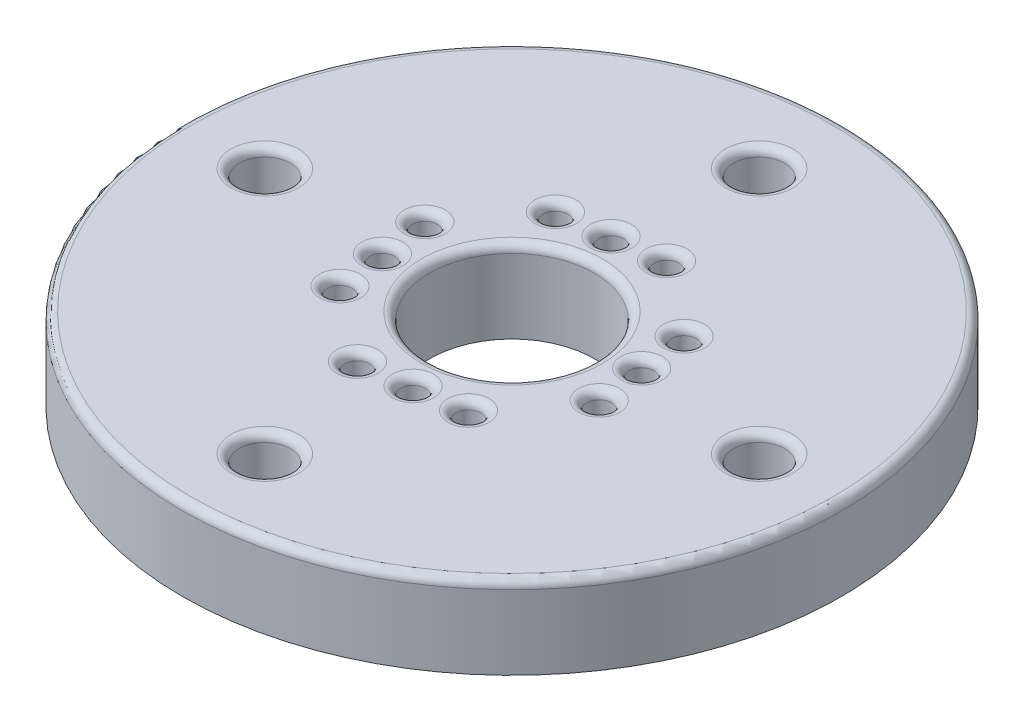
ISO-10303-21;
HEADER;
FILE_DESCRIPTION(('STEP AP214'),'2;1');
FILE_NAME('part.step','',(''),(''),'','','');
FILE_SCHEMA(('AUTOMOTIVE_DESIGN { 1 0 10303 214 1 1 1 1 }'));
ENDSEC;
DATA;
#1=APPLICATION_CONTEXT('core data for automotive mechanical design processes');
#2=APPLICATION_PROTOCOL_DEFINITION('international standard','automotive_design',2000,#1);
#3=PRODUCT_CONTEXT('',#1,'mechanical');
#4=PRODUCT('Part','Part','',(#3));
#5=PRODUCT_RELATED_PRODUCT_CATEGORY('part','',(#4));
#6=PRODUCT_DEFINITION_FORMATION('','',#4);
#7=PRODUCT_DEFINITION_CONTEXT('part definition',#1,'design');
#8=PRODUCT_DEFINITION('design','',#6,#7);
#9=PRODUCT_DEFINITION_SHAPE('','',#8);
#10=(LENGTH_UNIT() NAMED_UNIT(*) SI_UNIT(.MILLI.,.METRE.));
#11=(NAMED_UNIT(*) PLANE_ANGLE_UNIT() SI_UNIT($,.RADIAN.));
#12=(NAMED_UNIT(*) SI_UNIT($,.STERADIAN.) SOLID_ANGLE_UNIT());
#13=UNCERTAINTY_MEASURE_WITH_UNIT(LENGTH_MEASURE(1.E-05),#10,'distance_accuracy_value','');
#14=(GEOMETRIC_REPRESENTATION_CONTEXT(3) GLOBAL_UNCERTAINTY_ASSIGNED_CONTEXT((#13)) GLOBAL_UNIT_ASSIGNED_CONTEXT((#10,
#11,#12)) REPRESENTATION_CONTEXT('',''));
#15=CARTESIAN_POINT('',(0.,0.,0.));
#16=DIRECTION('',(0.,0.,1.));
#17=DIRECTION('',(1.,0.,0.));
#18=AXIS2_PLACEMENT_3D('',#15,#16,#17);
#19=CARTESIAN_POINT('',(0.,5.,0.));
#20=DIRECTION('',(0.,1.,0.));
#21=DIRECTION('',(0.,0.,1.));
#22=AXIS2_PLACEMENT_3D('',#19,#20,#21);
#23=PLANE('',#22);
#24=CARTESIAN_POINT('',(-6.93810907752434,5.,0.92878545874405));
#25=DIRECTION('',(0.,1.,0.));
#26=DIRECTION('',(0.,0.,1.));
#27=AXIS2_PLACEMENT_3D('',#24,#25,#26);
#28=CIRCLE('',#27,1.25000000001407);
#29=CARTESIAN_POINT('',(-6.93810907752434,5.,2.17878545875812));
#30=VERTEX_POINT('',#29);
#31=EDGE_CURVE('E75',#30,#30,#28,.F.);
#32=ORIENTED_EDGE('',*,*,#31,.T.);
#33=EDGE_LOOP('',(#32));
#34=FACE_BOUND('',#33,.T.);
#35=CARTESIAN_POINT('',(-0.928785458744027,5.,-6.93810907752434));
#36=DIRECTION('',(0.,1.,0.));
#37=DIRECTION('',(0.,0.,1.));
#38=AXIS2_PLACEMENT_3D('',#35,#36,#37);
#39=CIRCLE('',#38,1.25000000001546);
#40=CARTESIAN_POINT('',(-0.928785458744027,5.,-5.68810907750888));
#41=VERTEX_POINT('',#40);
#42=EDGE_CURVE('E78',#41,#41,#39,.F.);
#43=ORIENTED_EDGE('',*,*,#42,.T.);
#44=EDGE_LOOP('',(#43));
#45=FACE_BOUND('',#44,.T.);
#46=CARTESIAN_POINT('',(-6.54005816663406,5.,3.90226077768306));
#47=DIRECTION('',(0.,1.,0.));
#48=DIRECTION('',(0.,0.,1.));
#49=AXIS2_PLACEMENT_3D('',#46,#47,#48);
#50=CIRCLE('',#49,1.25000000001367);
#51=CARTESIAN_POINT('',(-6.54005816663406,5.,5.15226077769672));
#52=VERTEX_POINT('',#51);
#53=EDGE_CURVE('E81',#52,#52,#50,.F.);
#54=ORIENTED_EDGE('',*,*,#53,.T.);
#55=EDGE_LOOP('',(#54));
#56=FACE_BOUND('',#55,.T.);
#57=CARTESIAN_POINT('',(-3.90226077768303,5.,-6.54005816663406));
#58=DIRECTION('',(0.,1.,0.));
#59=DIRECTION('',(0.,0.,1.));
#60=AXIS2_PLACEMENT_3D('',#57,#58,#59);
#61=CIRCLE('',#60,1.25000000001527);
#62=CARTESIAN_POINT('',(-3.90226077768303,5.,-5.29005816661879));
#63=VERTEX_POINT('',#62);
#64=EDGE_CURVE('E84',#63,#63,#61,.F.);
#65=ORIENTED_EDGE('',*,*,#64,.T.);
#66=EDGE_LOOP('',(#65));
#67=FACE_BOUND('',#66,.T.);
#68=CARTESIAN_POINT('',(-7.33615998841461,5.,-2.04468986019495));
#69=DIRECTION('',(0.,1.,0.));
#70=DIRECTION('',(0.,0.,1.));
#71=AXIS2_PLACEMENT_3D('',#68,#69,#70);
#72=CIRCLE('',#71,1.25000000001448);
#73=CARTESIAN_POINT('',(-7.33615998841461,5.,-0.794689860180473));
#74=VERTEX_POINT('',#73);
#75=EDGE_CURVE('E87',#74,#74,#72,.F.);
#76=ORIENTED_EDGE('',*,*,#75,.T.);
#77=EDGE_LOOP('',(#76));
#78=FACE_BOUND('',#77,.T.);
#79=CARTESIAN_POINT('',(2.04468986019498,5.,-7.33615998841462));
#80=DIRECTION('',(0.,1.,0.));
#81=DIRECTION('',(0.,0.,1.));
#82=AXIS2_PLACEMENT_3D('',#79,#80,#81);
#83=CIRCLE('',#82,1.25000000001565);
#84=CARTESIAN_POINT('',(2.04468986019498,5.,-6.08615998839897));
#85=VERTEX_POINT('',#84);
#86=EDGE_CURVE('E90',#85,#85,#83,.F.);
#87=ORIENTED_EDGE('',*,*,#86,.T.);
#88=EDGE_LOOP('',(#87));
#89=FACE_BOUND('',#88,.T.);
#90=CARTESIAN_POINT('',(6.54005816663407,5.,-3.90226077768298));
#91=DIRECTION('',(0.,1.,0.));
#92=DIRECTION('',(0.,0.,1.));
#93=AXIS2_PLACEMENT_3D('',#90,#91,#92);
#94=CIRCLE('',#93,1.25000000001535);
#95=CARTESIAN_POINT('',(6.54005816663407,5.,-2.65226077766763));
#96=VERTEX_POINT('',#95);
#97=EDGE_CURVE('E93',#96,#96,#94,.F.);
#98=ORIENTED_EDGE('',*,*,#97,.T.);
#99=EDGE_LOOP('',(#98));
#100=FACE_BOUND('',#99,.T.);
#101=CARTESIAN_POINT('',(6.93810907752434,5.,-0.928785458744002));
#102=DIRECTION('',(0.,1.,0.));
#103=DIRECTION('',(0.,0.,1.));
#104=AXIS2_PLACEMENT_3D('',#101,#102,#103);
#105=CIRCLE('',#104,1.25000000001494);
#106=CARTESIAN_POINT('',(6.93810907752434,5.,0.321214541270942));
#107=VERTEX_POINT('',#106);
#108=EDGE_CURVE('E96',#107,#107,#105,.F.);
#109=ORIENTED_EDGE('',*,*,#108,.T.);
#110=EDGE_LOOP('',(#109));
#111=FACE_BOUND('',#110,.T.);
#112=CARTESIAN_POINT('',(7.33615998841462,5.,2.04468986019503));
#113=DIRECTION('',(0.,1.,0.));
#114=DIRECTION('',(0.,0.,1.));
#115=AXIS2_PLACEMENT_3D('',#112,#113,#114);
#116=CIRCLE('',#115,1.25000000001454);
#117=CARTESIAN_POINT('',(7.33615998841462,5.,3.29468986020957));
#118=VERTEX_POINT('',#117);
#119=EDGE_CURVE('E99',#118,#118,#116,.F.);
#120=ORIENTED_EDGE('',*,*,#119,.T.);
#121=EDGE_LOOP('',(#120));
#122=FACE_BOUND('',#121,.T.);
#123=CARTESIAN_POINT('',(3.90226077768298,5.,6.54005816663407));
#124=DIRECTION('',(0.,1.,0.));
#125=DIRECTION('',(0.,0.,1.));
#126=AXIS2_PLACEMENT_3D('',#123,#124,#125);
#127=CIRCLE('',#126,1.25000000001374);
#128=CARTESIAN_POINT('',(3.90226077768298,5.,7.79005816664782));
#129=VERTEX_POINT('',#128);
#130=EDGE_CURVE('E102',#129,#129,#127,.F.);
#131=ORIENTED_EDGE('',*,*,#130,.T.);
#132=EDGE_LOOP('',(#131));
#133=FACE_BOUND('',#132,.T.);
#134=CARTESIAN_POINT('',(0.928785458743978,5.,6.93810907752435));
#135=DIRECTION('',(0.,1.,0.));
#136=DIRECTION('',(0.,0.,1.));
#137=AXIS2_PLACEMENT_3D('',#134,#135,#136);
#138=CIRCLE('',#137,1.25000000001356);
#139=CARTESIAN_POINT('',(0.928785458743978,5.,8.18810907753791));
#140=VERTEX_POINT('',#139);
#141=EDGE_CURVE('E105',#140,#140,#138,.F.);
#142=ORIENTED_EDGE('',*,*,#141,.T.);
#143=EDGE_LOOP('',(#142));
#144=FACE_BOUND('',#143,.T.);
#145=CARTESIAN_POINT('',(-2.04468986019503,5.,7.33615998841462));
#146=DIRECTION('',(0.,1.,0.));
#147=DIRECTION('',(0.,0.,1.));
#148=AXIS2_PLACEMENT_3D('',#145,#146,#147);
#149=CIRCLE('',#148,1.25000000001337);
#150=CARTESIAN_POINT('',(-2.04468986019503,5.,8.586159988428));
#151=VERTEX_POINT('',#150);
#152=EDGE_CURVE('E108',#151,#151,#149,.F.);
#153=ORIENTED_EDGE('',*,*,#152,.T.);
#154=EDGE_LOOP('',(#153));
#155=FACE_BOUND('',#154,.T.);
#156=CARTESIAN_POINT('',(0.,5.,0.));
#157=DIRECTION('',(0.,1.,0.));
#158=DIRECTION('',(0.,0.,1.));
#159=AXIS2_PLACEMENT_3D('',#156,#157,#158);
#160=CIRCLE('',#159,5.5);
#161=CARTESIAN_POINT('',(0.,5.,5.5));
#162=VERTEX_POINT('',#161);
#163=EDGE_CURVE('E163',#162,#162,#160,.F.);
#164=ORIENTED_EDGE('',*,*,#163,.T.);
#165=EDGE_LOOP('',(#164));
#166=FACE_BOUND('',#165,.T.);
#167=CARTESIAN_POINT('',(0.,5.,15.));
#168=DIRECTION('',(0.,1.,0.));
#169=DIRECTION('',(0.,0.,1.));
#170=AXIS2_PLACEMENT_3D('',#167,#168,#169);
#171=CIRCLE('',#170,2.05);
#172=CARTESIAN_POINT('',(0.,5.,17.05));
#173=VERTEX_POINT('',#172);
#174=EDGE_CURVE('E166',#173,#173,#171,.F.);
#175=ORIENTED_EDGE('',*,*,#174,.T.);
#176=EDGE_LOOP('',(#175));
#177=FACE_BOUND('',#176,.T.);
#178=CARTESIAN_POINT('',(0.,5.,-15.));
#179=DIRECTION('',(0.,1.,0.));
#180=DIRECTION('',(0.,0.,1.));
#181=AXIS2_PLACEMENT_3D('',#178,#179,#180);
#182=CIRCLE('',#181,2.05);
#183=CARTESIAN_POINT('',(0.,5.,-12.95));
#184=VERTEX_POINT('',#183);
#185=EDGE_CURVE('E169',#184,#184,#182,.F.);
#186=ORIENTED_EDGE('',*,*,#185,.T.);
#187=EDGE_LOOP('',(#186));
#188=FACE_BOUND('',#187,.T.);
#189=CARTESIAN_POINT('',(0.,5.,0.));
#190=DIRECTION('',(0.,1.,0.));
#191=DIRECTION('',(0.,0.,1.));
#192=AXIS2_PLACEMENT_3D('',#189,#190,#191);
#193=CIRCLE('',#192,19.5);
#194=CARTESIAN_POINT('',(0.,5.,19.5));
#195=VERTEX_POINT('',#194);
#196=EDGE_CURVE('E172',#195,#195,#193,.T.);
#197=ORIENTED_EDGE('',*,*,#196,.T.);
#198=EDGE_LOOP('',(#197));
#199=FACE_BOUND('',#198,.T.);
#200=CARTESIAN_POINT('',(15.,5.,0.));
#201=DIRECTION('',(0.,1.,0.));
#202=DIRECTION('',(0.,0.,1.));
#203=AXIS2_PLACEMENT_3D('',#200,#201,#202);
#204=CIRCLE('',#203,2.05);
#205=CARTESIAN_POINT('',(15.,5.,2.05));
#206=VERTEX_POINT('',#205);
#207=EDGE_CURVE('E175',#206,#206,#204,.F.);
#208=ORIENTED_EDGE('',*,*,#207,.T.);
#209=EDGE_LOOP('',(#208));
#210=FACE_BOUND('',#209,.T.);
#211=CARTESIAN_POINT('',(-15.,5.,0.));
#212=DIRECTION('',(0.,1.,0.));
#213=DIRECTION('',(0.,0.,1.));
#214=AXIS2_PLACEMENT_3D('',#211,#212,#213);
#215=CIRCLE('',#214,2.05);
#216=CARTESIAN_POINT('',(-15.,5.,2.05));
#217=VERTEX_POINT('',#216);
#218=EDGE_CURVE('E178',#217,#217,#215,.F.);
#219=ORIENTED_EDGE('',*,*,#218,.T.);
#220=EDGE_LOOP('',(#219));
#221=FACE_BOUND('',#220,.T.);
#222=ADVANCED_FACE('F31',(#34,#45,#56,#67,#78,#89,#100,#111,#122,#133,#144,#155,#166,#177,#188,
#199,#210,#221),#23,.T.);
#223=CARTESIAN_POINT('',(0.,0.,0.));
#224=DIRECTION('',(0.,1.,0.));
#225=DIRECTION('',(0.,0.,1.));
#226=AXIS2_PLACEMENT_3D('',#223,#224,#225);
#227=PLANE('',#226);
#228=CARTESIAN_POINT('',(-2.04468986019503,0.,7.33615998841462));
#229=DIRECTION('',(0.,1.,0.));
#230=DIRECTION('',(0.,0.,1.));
#231=AXIS2_PLACEMENT_3D('',#228,#229,#230);
#232=CIRCLE('',#231,0.750000000013371);
#233=CARTESIAN_POINT('',(-2.04468986019503,0.,8.08615998842799));
#234=VERTEX_POINT('',#233);
#235=EDGE_CURVE('E112',#234,#234,#232,.T.);
#236=ORIENTED_EDGE('',*,*,#235,.T.);
#237=EDGE_LOOP('',(#236));
#238=FACE_BOUND('',#237,.T.);
#239=CARTESIAN_POINT('',(0.928785458743978,0.,6.93810907752435));
#240=DIRECTION('',(0.,1.,0.));
#241=DIRECTION('',(0.,0.,1.));
#242=AXIS2_PLACEMENT_3D('',#239,#240,#241);
#243=CIRCLE('',#242,0.750000000013558);
#244=CARTESIAN_POINT('',(0.928785458743978,0.,7.6881090775379));
#245=VERTEX_POINT('',#244);
#246=EDGE_CURVE('E116',#245,#245,#243,.T.);
#247=ORIENTED_EDGE('',*,*,#246,.T.);
#248=EDGE_LOOP('',(#247));
#249=FACE_BOUND('',#248,.T.);
#250=CARTESIAN_POINT('',(3.90226077768298,0.,6.54005816663407));
#251=DIRECTION('',(0.,1.,0.));
#252=DIRECTION('',(0.,0.,1.));
#253=AXIS2_PLACEMENT_3D('',#250,#251,#252);
#254=CIRCLE('',#253,0.750000000013744);
#255=CARTESIAN_POINT('',(3.90226077768298,0.,7.29005816664782));
#256=VERTEX_POINT('',#255);
#257=EDGE_CURVE('E119',#256,#256,#254,.T.);
#258=ORIENTED_EDGE('',*,*,#257,.T.);
#259=EDGE_LOOP('',(#258));
#260=FACE_BOUND('',#259,.T.);
#261=CARTESIAN_POINT('',(7.33615998841462,0.,2.04468986019503));
#262=DIRECTION('',(0.,1.,0.));
#263=DIRECTION('',(0.,0.,1.));
#264=AXIS2_PLACEMENT_3D('',#261,#262,#263);
#265=CIRCLE('',#264,0.750000000014537);
#266=CARTESIAN_POINT('',(7.33615998841462,0.,2.79468986020957));
#267=VERTEX_POINT('',#266);
#268=EDGE_CURVE('E122',#267,#267,#265,.T.);
#269=ORIENTED_EDGE('',*,*,#268,.T.);
#270=EDGE_LOOP('',(#269));
#271=FACE_BOUND('',#270,.T.);
#272=CARTESIAN_POINT('',(6.93810907752434,0.,-0.928785458744002));
#273=DIRECTION('',(0.,1.,0.));
#274=DIRECTION('',(0.,0.,1.));
#275=AXIS2_PLACEMENT_3D('',#272,#273,#274);
#276=CIRCLE('',#275,0.750000000014944);
#277=CARTESIAN_POINT('',(6.93810907752434,0.,-0.178785458729058));
#278=VERTEX_POINT('',#277);
#279=EDGE_CURVE('E125',#278,#278,#276,.T.);
#280=ORIENTED_EDGE('',*,*,#279,.T.);
#281=EDGE_LOOP('',(#280));
#282=FACE_BOUND('',#281,.T.);
#283=CARTESIAN_POINT('',(6.54005816663407,0.,-3.90226077768298));
#284=DIRECTION('',(0.,1.,0.));
#285=DIRECTION('',(0.,0.,1.));
#286=AXIS2_PLACEMENT_3D('',#283,#284,#285);
#287=CIRCLE('',#286,0.750000000015351);
#288=CARTESIAN_POINT('',(6.54005816663407,0.,-3.15226077766763));
#289=VERTEX_POINT('',#288);
#290=EDGE_CURVE('E128',#289,#289,#287,.T.);
#291=ORIENTED_EDGE('',*,*,#290,.T.);
#292=EDGE_LOOP('',(#291));
#293=FACE_BOUND('',#292,.T.);
#294=CARTESIAN_POINT('',(2.04468986019498,0.,-7.33615998841462));
#295=DIRECTION('',(0.,1.,0.));
#296=DIRECTION('',(0.,0.,1.));
#297=AXIS2_PLACEMENT_3D('',#294,#295,#296);
#298=CIRCLE('',#297,0.750000000015648);
#299=CARTESIAN_POINT('',(2.04468986019498,0.,-6.58615998839897));
#300=VERTEX_POINT('',#299);
#301=EDGE_CURVE('E131',#300,#300,#298,.T.);
#302=ORIENTED_EDGE('',*,*,#301,.T.);
#303=EDGE_LOOP('',(#302));
#304=FACE_BOUND('',#303,.T.);
#305=CARTESIAN_POINT('',(-7.33615998841461,0.,-2.04468986019495));
#306=DIRECTION('',(0.,1.,0.));
#307=DIRECTION('',(0.,0.,1.));
#308=AXIS2_PLACEMENT_3D('',#305,#306,#307);
#309=CIRCLE('',#308,0.750000000014481);
#310=CARTESIAN_POINT('',(-7.33615998841461,0.,-1.29468986018047));
#311=VERTEX_POINT('',#310);
#312=EDGE_CURVE('E134',#311,#311,#309,.T.);
#313=ORIENTED_EDGE('',*,*,#312,.T.);
#314=EDGE_LOOP('',(#313));
#315=FACE_BOUND('',#314,.T.);
#316=CARTESIAN_POINT('',(-3.90226077768303,0.,-6.54005816663406));
#317=DIRECTION('',(0.,1.,0.));
#318=DIRECTION('',(0.,0.,1.));
#319=AXIS2_PLACEMENT_3D('',#316,#317,#318);
#320=CIRCLE('',#319,0.750000000015274);
#321=CARTESIAN_POINT('',(-3.90226077768303,0.,-5.79005816661879));
#322=VERTEX_POINT('',#321);
#323=EDGE_CURVE('E137',#322,#322,#320,.T.);
#324=ORIENTED_EDGE('',*,*,#323,.T.);
#325=EDGE_LOOP('',(#324));
#326=FACE_BOUND('',#325,.T.);
#327=CARTESIAN_POINT('',(-6.54005816663406,0.,3.90226077768306));
#328=DIRECTION('',(0.,1.,0.));
#329=DIRECTION('',(0.,0.,1.));
#330=AXIS2_PLACEMENT_3D('',#327,#328,#329);
#331=CIRCLE('',#330,0.750000000013667);
#332=CARTESIAN_POINT('',(-6.54005816663406,0.,4.65226077769672));
#333=VERTEX_POINT('',#332);
#334=EDGE_CURVE('E140',#333,#333,#331,.T.);
#335=ORIENTED_EDGE('',*,*,#334,.T.);
#336=EDGE_LOOP('',(#335));
#337=FACE_BOUND('',#336,.T.);
#338=CARTESIAN_POINT('',(-0.928785458744027,0.,-6.93810907752434));
#339=DIRECTION('',(0.,1.,0.));
#340=DIRECTION('',(0.,0.,1.));
#341=AXIS2_PLACEMENT_3D('',#338,#339,#340);
#342=CIRCLE('',#341,0.750000000015461);
#343=CARTESIAN_POINT('',(-0.928785458744027,0.,-6.18810907750888));
#344=VERTEX_POINT('',#343);
#345=EDGE_CURVE('E143',#344,#344,#342,.T.);
#346=ORIENTED_EDGE('',*,*,#345,.T.);
#347=EDGE_LOOP('',(#346));
#348=FACE_BOUND('',#347,.T.);
#349=CARTESIAN_POINT('',(-6.93810907752434,0.,0.92878545874405));
#350=DIRECTION('',(0.,1.,0.));
#351=DIRECTION('',(0.,0.,1.));
#352=AXIS2_PLACEMENT_3D('',#349,#350,#351);
#353=CIRCLE('',#352,0.750000000014074);
#354=CARTESIAN_POINT('',(-6.93810907752434,0.,1.67878545875812));
#355=VERTEX_POINT('',#354);
#356=EDGE_CURVE('E146',#355,#355,#353,.T.);
#357=ORIENTED_EDGE('',*,*,#356,.T.);
#358=EDGE_LOOP('',(#357));
#359=FACE_BOUND('',#358,.T.);
#360=CARTESIAN_POINT('',(0.,0.,0.));
#361=DIRECTION('',(0.,1.,0.));
#362=DIRECTION('',(0.,0.,1.));
#363=AXIS2_PLACEMENT_3D('',#360,#361,#362);
#364=CIRCLE('',#363,20.);
#365=CARTESIAN_POINT('',(0.,0.,20.));
#366=VERTEX_POINT('',#365);
#367=EDGE_CURVE('E184',#366,#366,#364,.T.);
#368=ORIENTED_EDGE('',*,*,#367,.F.);
#369=EDGE_LOOP('',(#368));
#370=FACE_BOUND('',#369,.T.);
#371=CARTESIAN_POINT('',(0.,0.,-15.));
#372=DIRECTION('',(0.,1.,0.));
#373=DIRECTION('',(0.,0.,1.));
#374=AXIS2_PLACEMENT_3D('',#371,#372,#373);
#375=CIRCLE('',#374,1.55);
#376=CARTESIAN_POINT('',(0.,0.,-13.45));
#377=VERTEX_POINT('',#376);
#378=EDGE_CURVE('E187',#377,#377,#375,.T.);
#379=ORIENTED_EDGE('',*,*,#378,.T.);
#380=EDGE_LOOP('',(#379));
#381=FACE_BOUND('',#380,.T.);
#382=CARTESIAN_POINT('',(15.,0.,0.));
#383=DIRECTION('',(0.,1.,0.));
#384=DIRECTION('',(0.,0.,1.));
#385=AXIS2_PLACEMENT_3D('',#382,#383,#384);
#386=CIRCLE('',#385,1.55);
#387=CARTESIAN_POINT('',(15.,0.,1.55));
#388=VERTEX_POINT('',#387);
#389=EDGE_CURVE('E190',#388,#388,#386,.T.);
#390=ORIENTED_EDGE('',*,*,#389,.T.);
#391=EDGE_LOOP('',(#390));
#392=FACE_BOUND('',#391,.T.);
#393=CARTESIAN_POINT('',(0.,0.,15.));
#394=DIRECTION('',(0.,1.,0.));
#395=DIRECTION('',(0.,0.,1.));
#396=AXIS2_PLACEMENT_3D('',#393,#394,#395);
#397=CIRCLE('',#396,1.55);
#398=CARTESIAN_POINT('',(0.,0.,16.55));
#399=VERTEX_POINT('',#398);
#400=EDGE_CURVE('E193',#399,#399,#397,.T.);
#401=ORIENTED_EDGE('',*,*,#400,.T.);
#402=EDGE_LOOP('',(#401));
#403=FACE_BOUND('',#402,.T.);
#404=CARTESIAN_POINT('',(-15.,0.,0.));
#405=DIRECTION('',(0.,1.,0.));
#406=DIRECTION('',(0.,0.,1.));
#407=AXIS2_PLACEMENT_3D('',#404,#405,#406);
#408=CIRCLE('',#407,1.55);
#409=CARTESIAN_POINT('',(-15.,0.,1.55));
#410=VERTEX_POINT('',#409);
#411=EDGE_CURVE('E196',#410,#410,#408,.T.);
#412=ORIENTED_EDGE('',*,*,#411,.T.);
#413=EDGE_LOOP('',(#412));
#414=FACE_BOUND('',#413,.T.);
#415=CARTESIAN_POINT('',(0.,0.,0.));
#416=DIRECTION('',(0.,1.,0.));
#417=DIRECTION('',(0.,0.,1.));
#418=AXIS2_PLACEMENT_3D('',#415,#416,#417);
#419=CIRCLE('',#418,5.);
#420=CARTESIAN_POINT('',(0.,0.,5.));
#421=VERTEX_POINT('',#420);
#422=EDGE_CURVE('E115',#421,#421,#419,.T.);
#423=ORIENTED_EDGE('',*,*,#422,.T.);
#424=EDGE_LOOP('',(#423));
#425=FACE_BOUND('',#424,.T.);
#426=ADVANCED_FACE('F202',(#238,#249,#260,#271,#282,#293,#304,#315,#326,#337,#348,#359,#370,
#381,#392,#403,#414,#425),#227,.F.);
#427=CARTESIAN_POINT('',(0.,5.,0.));
#428=DIRECTION('',(0.,-1.,0.));
#429=DIRECTION('',(0.,0.,-1.));
#430=AXIS2_PLACEMENT_3D('',#427,#428,#429);
#431=CYLINDRICAL_SURFACE('',#430,20.);
#432=CARTESIAN_POINT('',(0.,4.5,0.));
#433=DIRECTION('',(0.,1.,0.));
#434=DIRECTION('',(0.,0.,1.));
#435=AXIS2_PLACEMENT_3D('',#432,#433,#434);
#436=CIRCLE('',#435,20.);
#437=CARTESIAN_POINT('',(0.,4.5,20.));
#438=VERTEX_POINT('',#437);
#439=EDGE_CURVE('E154',#438,#438,#436,.F.);
#440=ORIENTED_EDGE('',*,*,#439,.T.);
#441=EDGE_LOOP('',(#440));
#442=FACE_BOUND('',#441,.T.);
#443=ORIENTED_EDGE('',*,*,#367,.T.);
#444=EDGE_LOOP('',(#443));
#445=FACE_BOUND('',#444,.T.);
#446=ADVANCED_FACE('F227',(#442,#445),#431,.T.);
#447=CARTESIAN_POINT('',(0.,5.,-15.));
#448=DIRECTION('',(0.,-1.,0.));
#449=DIRECTION('',(0.,0.,-1.));
#450=AXIS2_PLACEMENT_3D('',#447,#448,#449);
#451=CYLINDRICAL_SURFACE('',#450,1.55);
#452=CARTESIAN_POINT('',(0.,4.5,-15.));
#453=DIRECTION('',(0.,1.,0.));
#454=DIRECTION('',(0.,0.,1.));
#455=AXIS2_PLACEMENT_3D('',#452,#453,#454);
#456=CIRCLE('',#455,1.55);
#457=CARTESIAN_POINT('',(0.,4.5,-13.45));
#458=VERTEX_POINT('',#457);
#459=EDGE_CURVE('E157',#458,#458,#456,.T.);
#460=ORIENTED_EDGE('',*,*,#459,.T.);
#461=EDGE_LOOP('',(#460));
#462=FACE_BOUND('',#461,.T.);
#463=ORIENTED_EDGE('',*,*,#378,.F.);
#464=EDGE_LOOP('',(#463));
#465=FACE_BOUND('',#464,.T.);
#466=ADVANCED_FACE('F232',(#462,#465),#451,.F.);
#467=CARTESIAN_POINT('',(15.,5.,0.));
#468=DIRECTION('',(0.,-1.,0.));
#469=DIRECTION('',(0.,0.,-1.));
#470=AXIS2_PLACEMENT_3D('',#467,#468,#469);
#471=CYLINDRICAL_SURFACE('',#470,1.55);
#472=CARTESIAN_POINT('',(15.,4.5,0.));
#473=DIRECTION('',(0.,1.,0.));
#474=DIRECTION('',(0.,0.,1.));
#475=AXIS2_PLACEMENT_3D('',#472,#473,#474);
#476=CIRCLE('',#475,1.55);
#477=CARTESIAN_POINT('',(15.,4.5,1.55));
#478=VERTEX_POINT('',#477);
#479=EDGE_CURVE('E151',#478,#478,#476,.T.);
#480=ORIENTED_EDGE('',*,*,#479,.T.);
#481=EDGE_LOOP('',(#480));
#482=FACE_BOUND('',#481,.T.);
#483=ORIENTED_EDGE('',*,*,#389,.F.);
#484=EDGE_LOOP('',(#483));
#485=FACE_BOUND('',#484,.T.);
#486=ADVANCED_FACE('F330',(#482,#485),#471,.F.);
#487=CARTESIAN_POINT('',(0.,5.,15.));
#488=DIRECTION('',(0.,-1.,0.));
#489=DIRECTION('',(0.,0.,-1.));
#490=AXIS2_PLACEMENT_3D('',#487,#488,#489);
#491=CYLINDRICAL_SURFACE('',#490,1.55);
#492=CARTESIAN_POINT('',(0.,4.5,15.));
#493=DIRECTION('',(0.,1.,0.));
#494=DIRECTION('',(0.,0.,1.));
#495=AXIS2_PLACEMENT_3D('',#492,#493,#494);
#496=CIRCLE('',#495,1.55);
#497=CARTESIAN_POINT('',(0.,4.5,16.55));
#498=VERTEX_POINT('',#497);
#499=EDGE_CURVE('E160',#498,#498,#496,.T.);
#500=ORIENTED_EDGE('',*,*,#499,.T.);
#501=EDGE_LOOP('',(#500));
#502=FACE_BOUND('',#501,.T.);
#503=ORIENTED_EDGE('',*,*,#400,.F.);
#504=EDGE_LOOP('',(#503));
#505=FACE_BOUND('',#504,.T.);
#506=ADVANCED_FACE('F217',(#502,#505),#491,.F.);
#507=CARTESIAN_POINT('',(-15.,5.,0.));
#508=DIRECTION('',(0.,-1.,0.));
#509=DIRECTION('',(0.,0.,-1.));
#510=AXIS2_PLACEMENT_3D('',#507,#508,#509);
#511=CYLINDRICAL_SURFACE('',#510,1.55);
#512=CARTESIAN_POINT('',(-15.,4.5,0.));
#513=DIRECTION('',(0.,1.,0.));
#514=DIRECTION('',(0.,0.,1.));
#515=AXIS2_PLACEMENT_3D('',#512,#513,#514);
#516=CIRCLE('',#515,1.55);
#517=CARTESIAN_POINT('',(-15.,4.5,1.55));
#518=VERTEX_POINT('',#517);
#519=EDGE_CURVE('E111',#518,#518,#516,.T.);
#520=ORIENTED_EDGE('',*,*,#519,.T.);
#521=EDGE_LOOP('',(#520));
#522=FACE_BOUND('',#521,.T.);
#523=ORIENTED_EDGE('',*,*,#411,.F.);
#524=EDGE_LOOP('',(#523));
#525=FACE_BOUND('',#524,.T.);
#526=ADVANCED_FACE('F207',(#522,#525),#511,.F.);
#527=CARTESIAN_POINT('',(0.,5.,0.));
#528=DIRECTION('',(0.,-1.,0.));
#529=DIRECTION('',(0.,0.,-1.));
#530=AXIS2_PLACEMENT_3D('',#527,#528,#529);
#531=CYLINDRICAL_SURFACE('',#530,5.);
#532=CARTESIAN_POINT('',(0.,4.5,0.));
#533=DIRECTION('',(0.,1.,0.));
#534=DIRECTION('',(0.,0.,1.));
#535=AXIS2_PLACEMENT_3D('',#532,#533,#534);
#536=CIRCLE('',#535,5.);
#537=CARTESIAN_POINT('',(0.,4.5,5.));
#538=VERTEX_POINT('',#537);
#539=EDGE_CURVE('E181',#538,#538,#536,.T.);
#540=ORIENTED_EDGE('',*,*,#539,.T.);
#541=EDGE_LOOP('',(#540));
#542=FACE_BOUND('',#541,.T.);
#543=ORIENTED_EDGE('',*,*,#422,.F.);
#544=EDGE_LOOP('',(#543));
#545=FACE_BOUND('',#544,.T.);
#546=ADVANCED_FACE('F204',(#542,#545),#531,.F.);
#547=CARTESIAN_POINT('',(0.,4.5,0.));
#548=DIRECTION('',(0.,1.,0.));
#549=DIRECTION('',(0.,0.,1.));
#550=AXIS2_PLACEMENT_3D('',#547,#548,#549);
#551=TOROIDAL_SURFACE('',#550,5.5,0.5);
#552=ORIENTED_EDGE('',*,*,#163,.F.);
#553=EDGE_LOOP('',(#552));
#554=FACE_BOUND('',#553,.T.);
#555=ORIENTED_EDGE('',*,*,#539,.F.);
#556=EDGE_LOOP('',(#555));
#557=FACE_BOUND('',#556,.T.);
#558=ADVANCED_FACE('F206',(#554,#557),#551,.T.);
#559=CARTESIAN_POINT('',(0.,4.5,15.));
#560=DIRECTION('',(0.,1.,0.));
#561=DIRECTION('',(0.,0.,1.));
#562=AXIS2_PLACEMENT_3D('',#559,#560,#561);
#563=TOROIDAL_SURFACE('',#562,2.05,0.5);
#564=ORIENTED_EDGE('',*,*,#174,.F.);
#565=EDGE_LOOP('',(#564));
#566=FACE_BOUND('',#565,.T.);
#567=ORIENTED_EDGE('',*,*,#499,.F.);
#568=EDGE_LOOP('',(#567));
#569=FACE_BOUND('',#568,.T.);
#570=ADVANCED_FACE('F214',(#566,#569),#563,.T.);
#571=CARTESIAN_POINT('',(0.,4.5,-15.));
#572=DIRECTION('',(0.,1.,0.));
#573=DIRECTION('',(0.,0.,1.));
#574=AXIS2_PLACEMENT_3D('',#571,#572,#573);
#575=TOROIDAL_SURFACE('',#574,2.05,0.5);
#576=ORIENTED_EDGE('',*,*,#185,.F.);
#577=EDGE_LOOP('',(#576));
#578=FACE_BOUND('',#577,.T.);
#579=ORIENTED_EDGE('',*,*,#459,.F.);
#580=EDGE_LOOP('',(#579));
#581=FACE_BOUND('',#580,.T.);
#582=ADVANCED_FACE('F240',(#578,#581),#575,.T.);
#583=CARTESIAN_POINT('',(0.,4.5,0.));
#584=DIRECTION('',(0.,1.,0.));
#585=DIRECTION('',(0.,0.,1.));
#586=AXIS2_PLACEMENT_3D('',#583,#584,#585);
#587=TOROIDAL_SURFACE('',#586,19.5,0.5);
#588=ORIENTED_EDGE('',*,*,#439,.F.);
#589=EDGE_LOOP('',(#588));
#590=FACE_BOUND('',#589,.T.);
#591=ORIENTED_EDGE('',*,*,#196,.F.);
#592=EDGE_LOOP('',(#591));
#593=FACE_BOUND('',#592,.T.);
#594=ADVANCED_FACE('F244',(#590,#593),#587,.T.);
#595=CARTESIAN_POINT('',(15.,4.5,0.));
#596=DIRECTION('',(0.,1.,0.));
#597=DIRECTION('',(0.,0.,1.));
#598=AXIS2_PLACEMENT_3D('',#595,#596,#597);
#599=TOROIDAL_SURFACE('',#598,2.05,0.5);
#600=ORIENTED_EDGE('',*,*,#207,.F.);
#601=EDGE_LOOP('',(#600));
#602=FACE_BOUND('',#601,.T.);
#603=ORIENTED_EDGE('',*,*,#479,.F.);
#604=EDGE_LOOP('',(#603));
#605=FACE_BOUND('',#604,.T.);
#606=ADVANCED_FACE('F248',(#602,#605),#599,.T.);
#607=CARTESIAN_POINT('',(-15.,4.5,0.));
#608=DIRECTION('',(0.,1.,0.));
#609=DIRECTION('',(0.,0.,1.));
#610=AXIS2_PLACEMENT_3D('',#607,#608,#609);
#611=TOROIDAL_SURFACE('',#610,2.05,0.5);
#612=ORIENTED_EDGE('',*,*,#218,.F.);
#613=EDGE_LOOP('',(#612));
#614=FACE_BOUND('',#613,.T.);
#615=ORIENTED_EDGE('',*,*,#519,.F.);
#616=EDGE_LOOP('',(#615));
#617=FACE_BOUND('',#616,.T.);
#618=ADVANCED_FACE('F252',(#614,#617),#611,.T.);
#619=CARTESIAN_POINT('',(-6.93810907752434,5.,0.92878545874405));
#620=DIRECTION('',(0.,-1.,0.));
#621=DIRECTION('',(0.,0.,-1.));
#622=AXIS2_PLACEMENT_3D('',#619,#620,#621);
#623=CYLINDRICAL_SURFACE('',#622,0.750000000014074);
#624=CARTESIAN_POINT('',(-6.93810907752434,4.5,0.92878545874405));
#625=DIRECTION('',(0.,1.,0.));
#626=DIRECTION('',(0.,0.,1.));
#627=AXIS2_PLACEMENT_3D('',#624,#625,#626);
#628=CIRCLE('',#627,0.750000000014074);
#629=CARTESIAN_POINT('',(-6.93810907752434,4.5,1.67878545875812));
#630=VERTEX_POINT('',#629);
#631=EDGE_CURVE('E72',#630,#630,#628,.T.);
#632=ORIENTED_EDGE('',*,*,#631,.T.);
#633=EDGE_LOOP('',(#632));
#634=FACE_BOUND('',#633,.T.);
#635=ORIENTED_EDGE('',*,*,#356,.F.);
#636=EDGE_LOOP('',(#635));
#637=FACE_BOUND('',#636,.T.);
#638=ADVANCED_FACE('F256',(#634,#637),#623,.F.);
#639=CARTESIAN_POINT('',(-0.928785458744027,5.,-6.93810907752434));
#640=DIRECTION('',(0.,-1.,0.));
#641=DIRECTION('',(0.,0.,-1.));
#642=AXIS2_PLACEMENT_3D('',#639,#640,#641);
#643=CYLINDRICAL_SURFACE('',#642,0.750000000015461);
#644=CARTESIAN_POINT('',(-0.928785458744027,4.5,-6.93810907752434));
#645=DIRECTION('',(0.,1.,0.));
#646=DIRECTION('',(0.,0.,1.));
#647=AXIS2_PLACEMENT_3D('',#644,#645,#646);
#648=CIRCLE('',#647,0.750000000015461);
#649=CARTESIAN_POINT('',(-0.928785458744027,4.5,-6.18810907750888));
#650=VERTEX_POINT('',#649);
#651=EDGE_CURVE('E69',#650,#650,#648,.T.);
#652=ORIENTED_EDGE('',*,*,#651,.T.);
#653=EDGE_LOOP('',(#652));
#654=FACE_BOUND('',#653,.T.);
#655=ORIENTED_EDGE('',*,*,#345,.F.);
#656=EDGE_LOOP('',(#655));
#657=FACE_BOUND('',#656,.T.);
#658=ADVANCED_FACE('F412',(#654,#657),#643,.F.);
#659=CARTESIAN_POINT('',(-6.54005816663406,5.,3.90226077768306));
#660=DIRECTION('',(0.,-1.,0.));
#661=DIRECTION('',(0.,0.,-1.));
#662=AXIS2_PLACEMENT_3D('',#659,#660,#661);
#663=CYLINDRICAL_SURFACE('',#662,0.750000000013667);
#664=CARTESIAN_POINT('',(-6.54005816663406,4.5,3.90226077768306));
#665=DIRECTION('',(0.,1.,0.));
#666=DIRECTION('',(0.,0.,1.));
#667=AXIS2_PLACEMENT_3D('',#664,#665,#666);
#668=CIRCLE('',#667,0.750000000013667);
#669=CARTESIAN_POINT('',(-6.54005816663406,4.5,4.65226077769672));
#670=VERTEX_POINT('',#669);
#671=EDGE_CURVE('E66',#670,#670,#668,.T.);
#672=ORIENTED_EDGE('',*,*,#671,.T.);
#673=EDGE_LOOP('',(#672));
#674=FACE_BOUND('',#673,.T.);
#675=ORIENTED_EDGE('',*,*,#334,.F.);
#676=EDGE_LOOP('',(#675));
#677=FACE_BOUND('',#676,.T.);
#678=ADVANCED_FACE('F421',(#674,#677),#663,.F.);
#679=CARTESIAN_POINT('',(-3.90226077768303,5.,-6.54005816663406));
#680=DIRECTION('',(0.,-1.,0.));
#681=DIRECTION('',(0.,0.,-1.));
#682=AXIS2_PLACEMENT_3D('',#679,#680,#681);
#683=CYLINDRICAL_SURFACE('',#682,0.750000000015274);
#684=CARTESIAN_POINT('',(-3.90226077768303,4.5,-6.54005816663406));
#685=DIRECTION('',(0.,1.,0.));
#686=DIRECTION('',(0.,0.,1.));
#687=AXIS2_PLACEMENT_3D('',#684,#685,#686);
#688=CIRCLE('',#687,0.750000000015274);
#689=CARTESIAN_POINT('',(-3.90226077768303,4.5,-5.79005816661879));
#690=VERTEX_POINT('',#689);
#691=EDGE_CURVE('E63',#690,#690,#688,.T.);
#692=ORIENTED_EDGE('',*,*,#691,.T.);
#693=EDGE_LOOP('',(#692));
#694=FACE_BOUND('',#693,.T.);
#695=ORIENTED_EDGE('',*,*,#323,.F.);
#696=EDGE_LOOP('',(#695));
#697=FACE_BOUND('',#696,.T.);
#698=ADVANCED_FACE('F431',(#694,#697),#683,.F.);
#699=CARTESIAN_POINT('',(-7.33615998841461,5.,-2.04468986019495));
#700=DIRECTION('',(0.,-1.,0.));
#701=DIRECTION('',(0.,0.,-1.));
#702=AXIS2_PLACEMENT_3D('',#699,#700,#701);
#703=CYLINDRICAL_SURFACE('',#702,0.750000000014481);
#704=CARTESIAN_POINT('',(-7.33615998841461,4.5,-2.04468986019495));
#705=DIRECTION('',(0.,1.,0.));
#706=DIRECTION('',(0.,0.,1.));
#707=AXIS2_PLACEMENT_3D('',#704,#705,#706);
#708=CIRCLE('',#707,0.750000000014481);
#709=CARTESIAN_POINT('',(-7.33615998841461,4.5,-1.29468986018047));
#710=VERTEX_POINT('',#709);
#711=EDGE_CURVE('E60',#710,#710,#708,.T.);
#712=ORIENTED_EDGE('',*,*,#711,.T.);
#713=EDGE_LOOP('',(#712));
#714=FACE_BOUND('',#713,.T.);
#715=ORIENTED_EDGE('',*,*,#312,.F.);
#716=EDGE_LOOP('',(#715));
#717=FACE_BOUND('',#716,.T.);
#718=ADVANCED_FACE('F441',(#714,#717),#703,.F.);
#719=CARTESIAN_POINT('',(2.04468986019498,5.,-7.33615998841462));
#720=DIRECTION('',(0.,-1.,0.));
#721=DIRECTION('',(0.,0.,-1.));
#722=AXIS2_PLACEMENT_3D('',#719,#720,#721);
#723=CYLINDRICAL_SURFACE('',#722,0.750000000015648);
#724=CARTESIAN_POINT('',(2.04468986019498,4.5,-7.33615998841462));
#725=DIRECTION('',(0.,1.,0.));
#726=DIRECTION('',(0.,0.,1.));
#727=AXIS2_PLACEMENT_3D('',#724,#725,#726);
#728=CIRCLE('',#727,0.750000000015648);
#729=CARTESIAN_POINT('',(2.04468986019498,4.5,-6.58615998839897));
#730=VERTEX_POINT('',#729);
#731=EDGE_CURVE('E57',#730,#730,#728,.T.);
#732=ORIENTED_EDGE('',*,*,#731,.T.);
#733=EDGE_LOOP('',(#732));
#734=FACE_BOUND('',#733,.T.);
#735=ORIENTED_EDGE('',*,*,#301,.F.);
#736=EDGE_LOOP('',(#735));
#737=FACE_BOUND('',#736,.T.);
#738=ADVANCED_FACE('F451',(#734,#737),#723,.F.);
#739=CARTESIAN_POINT('',(6.54005816663407,5.,-3.90226077768298));
#740=DIRECTION('',(0.,-1.,0.));
#741=DIRECTION('',(0.,0.,-1.));
#742=AXIS2_PLACEMENT_3D('',#739,#740,#741);
#743=CYLINDRICAL_SURFACE('',#742,0.750000000015351);
#744=CARTESIAN_POINT('',(6.54005816663407,4.5,-3.90226077768298));
#745=DIRECTION('',(0.,1.,0.));
#746=DIRECTION('',(0.,0.,1.));
#747=AXIS2_PLACEMENT_3D('',#744,#745,#746);
#748=CIRCLE('',#747,0.750000000015351);
#749=CARTESIAN_POINT('',(6.54005816663407,4.5,-3.15226077766763));
#750=VERTEX_POINT('',#749);
#751=EDGE_CURVE('E54',#750,#750,#748,.T.);
#752=ORIENTED_EDGE('',*,*,#751,.T.);
#753=EDGE_LOOP('',(#752));
#754=FACE_BOUND('',#753,.T.);
#755=ORIENTED_EDGE('',*,*,#290,.F.);
#756=EDGE_LOOP('',(#755));
#757=FACE_BOUND('',#756,.T.);
#758=ADVANCED_FACE('F461',(#754,#757),#743,.F.);
#759=CARTESIAN_POINT('',(6.93810907752434,5.,-0.928785458744002));
#760=DIRECTION('',(0.,-1.,0.));
#761=DIRECTION('',(0.,0.,-1.));
#762=AXIS2_PLACEMENT_3D('',#759,#760,#761);
#763=CYLINDRICAL_SURFACE('',#762,0.750000000014944);
#764=CARTESIAN_POINT('',(6.93810907752434,4.5,-0.928785458744002));
#765=DIRECTION('',(0.,1.,0.));
#766=DIRECTION('',(0.,0.,1.));
#767=AXIS2_PLACEMENT_3D('',#764,#765,#766);
#768=CIRCLE('',#767,0.750000000014944);
#769=CARTESIAN_POINT('',(6.93810907752434,4.5,-0.178785458729058));
#770=VERTEX_POINT('',#769);
#771=EDGE_CURVE('E51',#770,#770,#768,.T.);
#772=ORIENTED_EDGE('',*,*,#771,.T.);
#773=EDGE_LOOP('',(#772));
#774=FACE_BOUND('',#773,.T.);
#775=ORIENTED_EDGE('',*,*,#279,.F.);
#776=EDGE_LOOP('',(#775));
#777=FACE_BOUND('',#776,.T.);
#778=ADVANCED_FACE('F471',(#774,#777),#763,.F.);
#779=CARTESIAN_POINT('',(7.33615998841462,5.,2.04468986019503));
#780=DIRECTION('',(0.,-1.,0.));
#781=DIRECTION('',(0.,0.,-1.));
#782=AXIS2_PLACEMENT_3D('',#779,#780,#781);
#783=CYLINDRICAL_SURFACE('',#782,0.750000000014537);
#784=CARTESIAN_POINT('',(7.33615998841462,4.5,2.04468986019503));
#785=DIRECTION('',(0.,1.,0.));
#786=DIRECTION('',(0.,0.,1.));
#787=AXIS2_PLACEMENT_3D('',#784,#785,#786);
#788=CIRCLE('',#787,0.750000000014537);
#789=CARTESIAN_POINT('',(7.33615998841462,4.5,2.79468986020957));
#790=VERTEX_POINT('',#789);
#791=EDGE_CURVE('E46',#790,#790,#788,.T.);
#792=ORIENTED_EDGE('',*,*,#791,.T.);
#793=EDGE_LOOP('',(#792));
#794=FACE_BOUND('',#793,.T.);
#795=ORIENTED_EDGE('',*,*,#268,.F.);
#796=EDGE_LOOP('',(#795));
#797=FACE_BOUND('',#796,.T.);
#798=ADVANCED_FACE('F481',(#794,#797),#783,.F.);
#799=CARTESIAN_POINT('',(3.90226077768298,5.,6.54005816663407));
#800=DIRECTION('',(0.,-1.,0.));
#801=DIRECTION('',(0.,0.,-1.));
#802=AXIS2_PLACEMENT_3D('',#799,#800,#801);
#803=CYLINDRICAL_SURFACE('',#802,0.750000000013744);
#804=CARTESIAN_POINT('',(3.90226077768298,4.5,6.54005816663407));
#805=DIRECTION('',(0.,1.,0.));
#806=DIRECTION('',(0.,0.,1.));
#807=AXIS2_PLACEMENT_3D('',#804,#805,#806);
#808=CIRCLE('',#807,0.750000000013744);
#809=CARTESIAN_POINT('',(3.90226077768298,4.5,7.29005816664782));
#810=VERTEX_POINT('',#809);
#811=EDGE_CURVE('E42',#810,#810,#808,.T.);
#812=ORIENTED_EDGE('',*,*,#811,.T.);
#813=EDGE_LOOP('',(#812));
#814=FACE_BOUND('',#813,.T.);
#815=ORIENTED_EDGE('',*,*,#257,.F.);
#816=EDGE_LOOP('',(#815));
#817=FACE_BOUND('',#816,.T.);
#818=ADVANCED_FACE('F491',(#814,#817),#803,.F.);
#819=CARTESIAN_POINT('',(0.928785458743978,5.,6.93810907752435));
#820=DIRECTION('',(0.,-1.,0.));
#821=DIRECTION('',(0.,0.,-1.));
#822=AXIS2_PLACEMENT_3D('',#819,#820,#821);
#823=CYLINDRICAL_SURFACE('',#822,0.750000000013558);
#824=CARTESIAN_POINT('',(0.928785458743978,4.5,6.93810907752435));
#825=DIRECTION('',(0.,1.,0.));
#826=DIRECTION('',(0.,0.,1.));
#827=AXIS2_PLACEMENT_3D('',#824,#825,#826);
#828=CIRCLE('',#827,0.750000000013558);
#829=CARTESIAN_POINT('',(0.928785458743978,4.5,7.6881090775379));
#830=VERTEX_POINT('',#829);
#831=EDGE_CURVE('E38',#830,#830,#828,.T.);
#832=ORIENTED_EDGE('',*,*,#831,.T.);
#833=EDGE_LOOP('',(#832));
#834=FACE_BOUND('',#833,.T.);
#835=ORIENTED_EDGE('',*,*,#246,.F.);
#836=EDGE_LOOP('',(#835));
#837=FACE_BOUND('',#836,.T.);
#838=ADVANCED_FACE('F501',(#834,#837),#823,.F.);
#839=CARTESIAN_POINT('',(-2.04468986019503,5.,7.33615998841462));
#840=DIRECTION('',(0.,-1.,0.));
#841=DIRECTION('',(0.,0.,-1.));
#842=AXIS2_PLACEMENT_3D('',#839,#840,#841);
#843=CYLINDRICAL_SURFACE('',#842,0.750000000013371);
#844=CARTESIAN_POINT('',(-2.04468986019503,4.5,7.33615998841462));
#845=DIRECTION('',(0.,1.,0.));
#846=DIRECTION('',(0.,0.,1.));
#847=AXIS2_PLACEMENT_3D('',#844,#845,#846);
#848=CIRCLE('',#847,0.750000000013371);
#849=CARTESIAN_POINT('',(-2.04468986019503,4.5,8.08615998842799));
#850=VERTEX_POINT('',#849);
#851=EDGE_CURVE('E10',#850,#850,#848,.T.);
#852=ORIENTED_EDGE('',*,*,#851,.T.);
#853=EDGE_LOOP('',(#852));
#854=FACE_BOUND('',#853,.T.);
#855=ORIENTED_EDGE('',*,*,#235,.F.);
#856=EDGE_LOOP('',(#855));
#857=FACE_BOUND('',#856,.T.);
#858=ADVANCED_FACE('F262',(#854,#857),#843,.F.);
#859=CARTESIAN_POINT('',(-6.93810907752434,4.5,0.92878545874405));
#860=DIRECTION('',(0.,1.,0.));
#861=DIRECTION('',(0.,0.,1.));
#862=AXIS2_PLACEMENT_3D('',#859,#860,#861);
#863=TOROIDAL_SURFACE('',#862,1.25000000001407,0.5);
#864=ORIENTED_EDGE('',*,*,#631,.F.);
#865=EDGE_LOOP('',(#864));
#866=FACE_BOUND('',#865,.T.);
#867=ORIENTED_EDGE('',*,*,#31,.F.);
#868=EDGE_LOOP('',(#867));
#869=FACE_BOUND('',#868,.T.);
#870=ADVANCED_FACE('F258',(#866,#869),#863,.T.);
#871=CARTESIAN_POINT('',(-0.928785458744027,4.5,-6.93810907752434));
#872=DIRECTION('',(0.,1.,0.));
#873=DIRECTION('',(0.,0.,1.));
#874=AXIS2_PLACEMENT_3D('',#871,#872,#873);
#875=TOROIDAL_SURFACE('',#874,1.25000000001546,0.5);
#876=ORIENTED_EDGE('',*,*,#651,.F.);
#877=EDGE_LOOP('',(#876));
#878=FACE_BOUND('',#877,.T.);
#879=ORIENTED_EDGE('',*,*,#42,.F.);
#880=EDGE_LOOP('',(#879));
#881=FACE_BOUND('',#880,.T.);
#882=ADVANCED_FACE('F261',(#878,#881),#875,.T.);
#883=CARTESIAN_POINT('',(-6.54005816663406,4.5,3.90226077768306));
#884=DIRECTION('',(0.,1.,0.));
#885=DIRECTION('',(0.,0.,1.));
#886=AXIS2_PLACEMENT_3D('',#883,#884,#885);
#887=TOROIDAL_SURFACE('',#886,1.25000000001367,0.5);
#888=ORIENTED_EDGE('',*,*,#671,.F.);
#889=EDGE_LOOP('',(#888));
#890=FACE_BOUND('',#889,.T.);
#891=ORIENTED_EDGE('',*,*,#53,.F.);
#892=EDGE_LOOP('',(#891));
#893=FACE_BOUND('',#892,.T.);
#894=ADVANCED_FACE('F266',(#890,#893),#887,.T.);
#895=CARTESIAN_POINT('',(-3.90226077768303,4.5,-6.54005816663406));
#896=DIRECTION('',(0.,1.,0.));
#897=DIRECTION('',(0.,0.,1.));
#898=AXIS2_PLACEMENT_3D('',#895,#896,#897);
#899=TOROIDAL_SURFACE('',#898,1.25000000001527,0.5);
#900=ORIENTED_EDGE('',*,*,#691,.F.);
#901=EDGE_LOOP('',(#900));
#902=FACE_BOUND('',#901,.T.);
#903=ORIENTED_EDGE('',*,*,#64,.F.);
#904=EDGE_LOOP('',(#903));
#905=FACE_BOUND('',#904,.T.);
#906=ADVANCED_FACE('F270',(#902,#905),#899,.T.);
#907=CARTESIAN_POINT('',(-7.33615998841461,4.5,-2.04468986019495));
#908=DIRECTION('',(0.,1.,0.));
#909=DIRECTION('',(0.,0.,1.));
#910=AXIS2_PLACEMENT_3D('',#907,#908,#909);
#911=TOROIDAL_SURFACE('',#910,1.25000000001448,0.5);
#912=ORIENTED_EDGE('',*,*,#711,.F.);
#913=EDGE_LOOP('',(#912));
#914=FACE_BOUND('',#913,.T.);
#915=ORIENTED_EDGE('',*,*,#75,.F.);
#916=EDGE_LOOP('',(#915));
#917=FACE_BOUND('',#916,.T.);
#918=ADVANCED_FACE('F274',(#914,#917),#911,.T.);
#919=CARTESIAN_POINT('',(2.04468986019498,4.5,-7.33615998841462));
#920=DIRECTION('',(0.,1.,0.));
#921=DIRECTION('',(0.,0.,1.));
#922=AXIS2_PLACEMENT_3D('',#919,#920,#921);
#923=TOROIDAL_SURFACE('',#922,1.25000000001565,0.5);
#924=ORIENTED_EDGE('',*,*,#731,.F.);
#925=EDGE_LOOP('',(#924));
#926=FACE_BOUND('',#925,.T.);
#927=ORIENTED_EDGE('',*,*,#86,.F.);
#928=EDGE_LOOP('',(#927));
#929=FACE_BOUND('',#928,.T.);
#930=ADVANCED_FACE('F278',(#926,#929),#923,.T.);
#931=CARTESIAN_POINT('',(6.54005816663407,4.5,-3.90226077768298));
#932=DIRECTION('',(0.,1.,0.));
#933=DIRECTION('',(0.,0.,1.));
#934=AXIS2_PLACEMENT_3D('',#931,#932,#933);
#935=TOROIDAL_SURFACE('',#934,1.25000000001535,0.5);
#936=ORIENTED_EDGE('',*,*,#751,.F.);
#937=EDGE_LOOP('',(#936));
#938=FACE_BOUND('',#937,.T.);
#939=ORIENTED_EDGE('',*,*,#97,.F.);
#940=EDGE_LOOP('',(#939));
#941=FACE_BOUND('',#940,.T.);
#942=ADVANCED_FACE('F282',(#938,#941),#935,.T.);
#943=CARTESIAN_POINT('',(6.93810907752434,4.5,-0.928785458744002));
#944=DIRECTION('',(0.,1.,0.));
#945=DIRECTION('',(0.,0.,1.));
#946=AXIS2_PLACEMENT_3D('',#943,#944,#945);
#947=TOROIDAL_SURFACE('',#946,1.25000000001494,0.5);
#948=ORIENTED_EDGE('',*,*,#771,.F.);
#949=EDGE_LOOP('',(#948));
#950=FACE_BOUND('',#949,.T.);
#951=ORIENTED_EDGE('',*,*,#108,.F.);
#952=EDGE_LOOP('',(#951));
#953=FACE_BOUND('',#952,.T.);
#954=ADVANCED_FACE('F286',(#950,#953),#947,.T.);
#955=CARTESIAN_POINT('',(7.33615998841462,4.5,2.04468986019503));
#956=DIRECTION('',(0.,1.,0.));
#957=DIRECTION('',(0.,0.,1.));
#958=AXIS2_PLACEMENT_3D('',#955,#956,#957);
#959=TOROIDAL_SURFACE('',#958,1.25000000001454,0.5);
#960=ORIENTED_EDGE('',*,*,#791,.F.);
#961=EDGE_LOOP('',(#960));
#962=FACE_BOUND('',#961,.T.);
#963=ORIENTED_EDGE('',*,*,#119,.F.);
#964=EDGE_LOOP('',(#963));
#965=FACE_BOUND('',#964,.T.);
#966=ADVANCED_FACE('F290',(#962,#965),#959,.T.);
#967=CARTESIAN_POINT('',(3.90226077768298,4.5,6.54005816663407));
#968=DIRECTION('',(0.,1.,0.));
#969=DIRECTION('',(0.,0.,1.));
#970=AXIS2_PLACEMENT_3D('',#967,#968,#969);
#971=TOROIDAL_SURFACE('',#970,1.25000000001374,0.5);
#972=ORIENTED_EDGE('',*,*,#811,.F.);
#973=EDGE_LOOP('',(#972));
#974=FACE_BOUND('',#973,.T.);
#975=ORIENTED_EDGE('',*,*,#130,.F.);
#976=EDGE_LOOP('',(#975));
#977=FACE_BOUND('',#976,.T.);
#978=ADVANCED_FACE('F294',(#974,#977),#971,.T.);
#979=CARTESIAN_POINT('',(0.928785458743978,4.5,6.93810907752435));
#980=DIRECTION('',(0.,1.,0.));
#981=DIRECTION('',(0.,0.,1.));
#982=AXIS2_PLACEMENT_3D('',#979,#980,#981);
#983=TOROIDAL_SURFACE('',#982,1.25000000001356,0.5);
#984=ORIENTED_EDGE('',*,*,#831,.F.);
#985=EDGE_LOOP('',(#984));
#986=FACE_BOUND('',#985,.T.);
#987=ORIENTED_EDGE('',*,*,#141,.F.);
#988=EDGE_LOOP('',(#987));
#989=FACE_BOUND('',#988,.T.);
#990=ADVANCED_FACE('F297',(#986,#989),#983,.T.);
#991=CARTESIAN_POINT('',(-2.04468986019503,4.5,7.33615998841462));
#992=DIRECTION('',(0.,1.,0.));
#993=DIRECTION('',(0.,0.,1.));
#994=AXIS2_PLACEMENT_3D('',#991,#992,#993);
#995=TOROIDAL_SURFACE('',#994,1.25000000001337,0.5);
#996=ORIENTED_EDGE('',*,*,#851,.F.);
#997=EDGE_LOOP('',(#996));
#998=FACE_BOUND('',#997,.T.);
#999=ORIENTED_EDGE('',*,*,#152,.F.);
#1000=EDGE_LOOP('',(#999));
#1001=FACE_BOUND('',#1000,.T.);
#1002=ADVANCED_FACE('F33',(#998,#1001),#995,.T.);
#1003=CLOSED_SHELL('',(#222,#426,#446,#466,#486,#506,#526,#546,#558,#570,#582,#594,#606,#618,
#638,#658,#678,#698,#718,#738,#758,#778,#798,#818,#838,#858,#870,#882,#894,#906,#918,#930,#942,
#954,#966,#978,#990,#1002));
#1004=MANIFOLD_SOLID_BREP('B2',#1003);
#1005=ADVANCED_BREP_SHAPE_REPRESENTATION('',(#18,#1004),#14);
#1006=SHAPE_DEFINITION_REPRESENTATION(#9,#1005);
ENDSEC;
END-ISO-10303-21;
